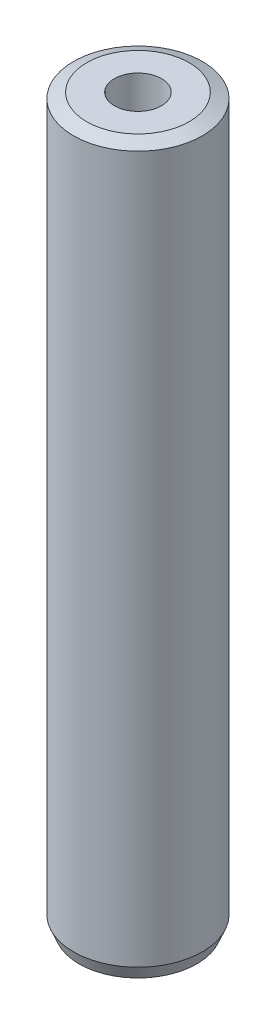
ISO-10303-21;
HEADER;
FILE_DESCRIPTION(('STEP AP214'),'2;1');
FILE_NAME('part.step','',(''),(''),'','','');
FILE_SCHEMA(('AUTOMOTIVE_DESIGN { 1 0 10303 214 1 1 1 1 }'));
ENDSEC;
DATA;
#1=APPLICATION_CONTEXT('core data for automotive mechanical design processes');
#2=APPLICATION_PROTOCOL_DEFINITION('international standard','automotive_design',2000,#1);
#3=PRODUCT_CONTEXT('',#1,'mechanical');
#4=PRODUCT('Part','Part','',(#3));
#5=PRODUCT_RELATED_PRODUCT_CATEGORY('part','',(#4));
#6=PRODUCT_DEFINITION_FORMATION('','',#4);
#7=PRODUCT_DEFINITION_CONTEXT('part definition',#1,'design');
#8=PRODUCT_DEFINITION('design','',#6,#7);
#9=PRODUCT_DEFINITION_SHAPE('','',#8);
#10=(LENGTH_UNIT() NAMED_UNIT(*) SI_UNIT(.MILLI.,.METRE.));
#11=(NAMED_UNIT(*) PLANE_ANGLE_UNIT() SI_UNIT($,.RADIAN.));
#12=(NAMED_UNIT(*) SI_UNIT($,.STERADIAN.) SOLID_ANGLE_UNIT());
#13=UNCERTAINTY_MEASURE_WITH_UNIT(LENGTH_MEASURE(1.E-05),#10,'distance_accuracy_value','');
#14=(GEOMETRIC_REPRESENTATION_CONTEXT(3) GLOBAL_UNCERTAINTY_ASSIGNED_CONTEXT((#13)) GLOBAL_UNIT_ASSIGNED_CONTEXT((#10,
#11,#12)) REPRESENTATION_CONTEXT('',''));
#15=CARTESIAN_POINT('',(0.,0.,0.));
#16=DIRECTION('',(0.,0.,1.));
#17=DIRECTION('',(1.,0.,0.));
#18=AXIS2_PLACEMENT_3D('',#15,#16,#17);
#19=CARTESIAN_POINT('',(0.,534.769255235558,0.));
#20=DIRECTION('',(0.,-1.,0.));
#21=DIRECTION('',(0.,0.,-1.));
#22=AXIS2_PLACEMENT_3D('',#19,#20,#21);
#23=CYLINDRICAL_SURFACE('',#22,47.5);
#24=CARTESIAN_POINT('',(0.,530.680435166227,0.));
#25=DIRECTION('',(0.,1.,0.));
#26=DIRECTION('',(0.,0.,1.));
#27=AXIS2_PLACEMENT_3D('',#24,#25,#26);
#28=CIRCLE('',#27,47.5);
#29=CARTESIAN_POINT('',(0.,530.680435166227,47.5));
#30=VERTEX_POINT('',#29);
#31=EDGE_CURVE('E50',#30,#30,#28,.F.);
#32=ORIENTED_EDGE('',*,*,#31,.T.);
#33=EDGE_LOOP('',(#32));
#34=FACE_BOUND('',#33,.T.);
#35=CARTESIAN_POINT('',(0.,9.77401814384304,0.));
#36=DIRECTION('',(0.,1.,0.));
#37=DIRECTION('',(0.,0.,1.));
#38=AXIS2_PLACEMENT_3D('',#35,#36,#37);
#39=CIRCLE('',#38,47.5);
#40=CARTESIAN_POINT('',(0.,9.77401814384304,47.5));
#41=VERTEX_POINT('',#40);
#42=EDGE_CURVE('E51',#41,#41,#39,.T.);
#43=ORIENTED_EDGE('',*,*,#42,.T.);
#44=EDGE_LOOP('',(#43));
#45=FACE_BOUND('',#44,.T.);
#46=ADVANCED_FACE('F39',(#34,#45),#23,.T.);
#47=CARTESIAN_POINT('',(0.,534.769255235558,0.));
#48=DIRECTION('',(0.,1.,0.));
#49=DIRECTION('',(0.,0.,1.));
#50=AXIS2_PLACEMENT_3D('',#47,#48,#49);
#51=PLANE('',#50);
#52=CARTESIAN_POINT('',(0.,534.769255235558,0.));
#53=DIRECTION('',(0.,1.,0.));
#54=DIRECTION('',(0.,0.,1.));
#55=AXIS2_PLACEMENT_3D('',#52,#53,#54);
#56=CIRCLE('',#55,37.7259818561576);
#57=CARTESIAN_POINT('',(0.,534.769255235558,37.7259818561576));
#58=VERTEX_POINT('',#57);
#59=EDGE_CURVE('E54',#58,#58,#56,.T.);
#60=ORIENTED_EDGE('',*,*,#59,.T.);
#61=EDGE_LOOP('',(#60));
#62=FACE_BOUND('',#61,.T.);
#63=CARTESIAN_POINT('',(0.,534.769255235558,0.));
#64=DIRECTION('',(0.,1.,0.));
#65=DIRECTION('',(0.,0.,1.));
#66=AXIS2_PLACEMENT_3D('',#63,#64,#65);
#67=CIRCLE('',#66,17.353628529683);
#68=CARTESIAN_POINT('',(0.,534.769255235558,17.353628529683));
#69=VERTEX_POINT('',#68);
#70=EDGE_CURVE('E58',#69,#69,#67,.T.);
#71=ORIENTED_EDGE('',*,*,#70,.F.);
#72=EDGE_LOOP('',(#71));
#73=FACE_BOUND('',#72,.T.);
#74=ADVANCED_FACE('F69',(#62,#73),#51,.T.);
#75=CARTESIAN_POINT('',(0.,0.,0.));
#76=DIRECTION('',(0.,1.,0.));
#77=DIRECTION('',(0.,0.,1.));
#78=AXIS2_PLACEMENT_3D('',#75,#76,#77);
#79=PLANE('',#78);
#80=CARTESIAN_POINT('',(0.,0.,0.));
#81=DIRECTION('',(0.,1.,0.));
#82=DIRECTION('',(0.,0.,1.));
#83=AXIS2_PLACEMENT_3D('',#80,#81,#82);
#84=CIRCLE('',#83,43.4111799306688);
#85=CARTESIAN_POINT('',(0.,0.,43.4111799306688));
#86=VERTEX_POINT('',#85);
#87=EDGE_CURVE('E10',#86,#86,#84,.F.);
#88=ORIENTED_EDGE('',*,*,#87,.T.);
#89=EDGE_LOOP('',(#88));
#90=FACE_BOUND('',#89,.T.);
#91=CARTESIAN_POINT('',(0.,0.,0.));
#92=DIRECTION('',(0.,1.,0.));
#93=DIRECTION('',(0.,0.,1.));
#94=AXIS2_PLACEMENT_3D('',#91,#92,#93);
#95=CIRCLE('',#94,17.353628529683);
#96=CARTESIAN_POINT('',(0.,0.,17.353628529683));
#97=VERTEX_POINT('',#96);
#98=EDGE_CURVE('E63',#97,#97,#95,.T.);
#99=ORIENTED_EDGE('',*,*,#98,.T.);
#100=EDGE_LOOP('',(#99));
#101=FACE_BOUND('',#100,.T.);
#102=ADVANCED_FACE('F75',(#90,#101),#79,.F.);
#103=CARTESIAN_POINT('',(0.,534.769255235558,0.));
#104=DIRECTION('',(0.,-1.,0.));
#105=DIRECTION('',(0.,0.,-1.));
#106=AXIS2_PLACEMENT_3D('',#103,#104,#105);
#107=CYLINDRICAL_SURFACE('',#106,17.353628529683);
#108=ORIENTED_EDGE('',*,*,#70,.T.);
#109=EDGE_LOOP('',(#108));
#110=FACE_BOUND('',#109,.T.);
#111=ORIENTED_EDGE('',*,*,#98,.F.);
#112=EDGE_LOOP('',(#111));
#113=FACE_BOUND('',#112,.T.);
#114=ADVANCED_FACE('F70',(#110,#113),#107,.F.);
#115=CARTESIAN_POINT('',(0.,534.769255235558,0.));
#116=DIRECTION('',(0.,-1.,0.));
#117=DIRECTION('',(0.,0.,-1.));
#118=AXIS2_PLACEMENT_3D('',#115,#116,#117);
#119=CONICAL_SURFACE('',#118,37.7259818561576,1.17458397216858);
#120=ORIENTED_EDGE('',*,*,#31,.F.);
#121=EDGE_LOOP('',(#120));
#122=FACE_BOUND('',#121,.T.);
#123=ORIENTED_EDGE('',*,*,#59,.F.);
#124=EDGE_LOOP('',(#123));
#125=FACE_BOUND('',#124,.T.);
#126=ADVANCED_FACE('F81',(#122,#125),#119,.T.);
#127=CARTESIAN_POINT('',(0.,9.77401814384304,0.));
#128=DIRECTION('',(0.,1.,0.));
#129=DIRECTION('',(0.,0.,1.));
#130=AXIS2_PLACEMENT_3D('',#127,#128,#129);
#131=CONICAL_SURFACE('',#130,47.5,0.396212354626316);
#132=ORIENTED_EDGE('',*,*,#87,.F.);
#133=EDGE_LOOP('',(#132));
#134=FACE_BOUND('',#133,.T.);
#135=ORIENTED_EDGE('',*,*,#42,.F.);
#136=EDGE_LOOP('',(#135));
#137=FACE_BOUND('',#136,.T.);
#138=ADVANCED_FACE('F45',(#134,#137),#131,.T.);
#139=CLOSED_SHELL('',(#46,#74,#102,#114,#126,#138));
#140=MANIFOLD_SOLID_BREP('B2',#139);
#141=ADVANCED_BREP_SHAPE_REPRESENTATION('',(#18,#140),#14);
#142=SHAPE_DEFINITION_REPRESENTATION(#9,#141);
ENDSEC;
END-ISO-10303-21;
